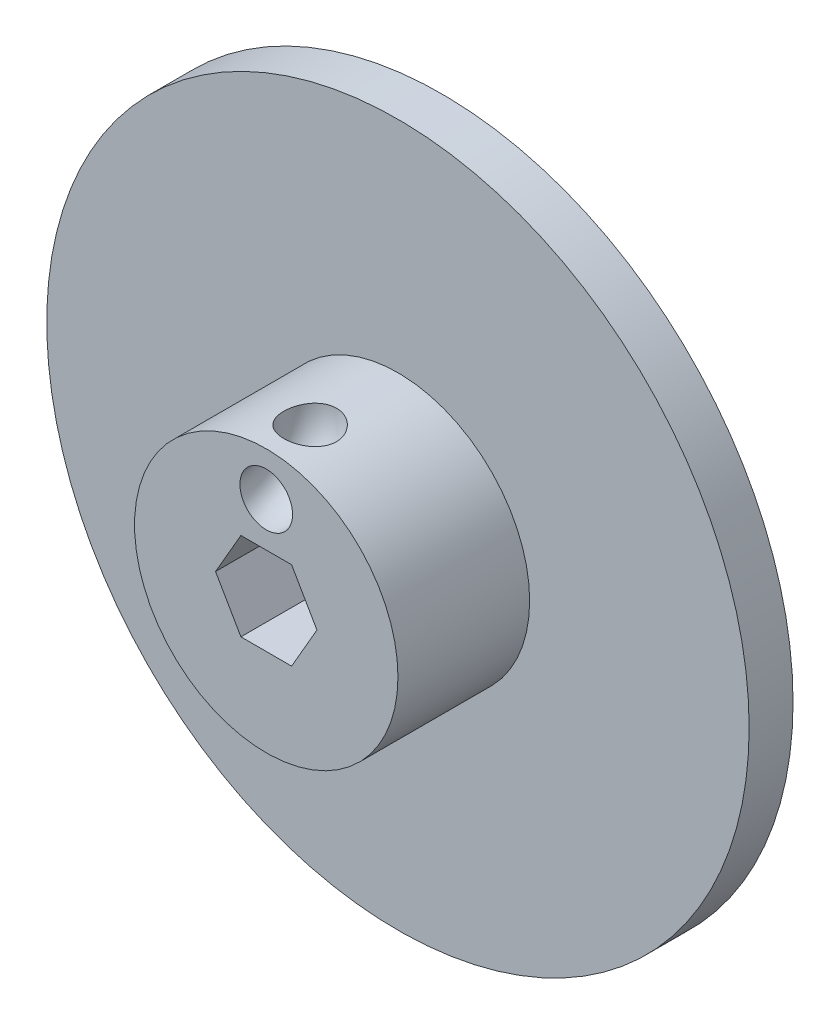
ISO-10303-21;
HEADER;
FILE_DESCRIPTION(('STEP AP214'),'2;1');
FILE_NAME('part.step','',(''),(''),'','','');
FILE_SCHEMA(('AUTOMOTIVE_DESIGN { 1 0 10303 214 1 1 1 1 }'));
ENDSEC;
DATA;
#1=APPLICATION_CONTEXT('core data for automotive mechanical design processes');
#2=APPLICATION_PROTOCOL_DEFINITION('international standard','automotive_design',2000,#1);
#3=PRODUCT_CONTEXT('',#1,'mechanical');
#4=PRODUCT('Part','Part','',(#3));
#5=PRODUCT_RELATED_PRODUCT_CATEGORY('part','',(#4));
#6=PRODUCT_DEFINITION_FORMATION('','',#4);
#7=PRODUCT_DEFINITION_CONTEXT('part definition',#1,'design');
#8=PRODUCT_DEFINITION('design','',#6,#7);
#9=PRODUCT_DEFINITION_SHAPE('','',#8);
#10=(LENGTH_UNIT() NAMED_UNIT(*) SI_UNIT(.MILLI.,.METRE.));
#11=(NAMED_UNIT(*) PLANE_ANGLE_UNIT() SI_UNIT($,.RADIAN.));
#12=(NAMED_UNIT(*) SI_UNIT($,.STERADIAN.) SOLID_ANGLE_UNIT());
#13=UNCERTAINTY_MEASURE_WITH_UNIT(LENGTH_MEASURE(1.E-05),#10,'distance_accuracy_value','');
#14=(GEOMETRIC_REPRESENTATION_CONTEXT(3) GLOBAL_UNCERTAINTY_ASSIGNED_CONTEXT((#13)) GLOBAL_UNIT_ASSIGNED_CONTEXT((#10,
#11,#12)) REPRESENTATION_CONTEXT('',''));
#15=CARTESIAN_POINT('',(0.,0.,0.));
#16=DIRECTION('',(0.,0.,1.));
#17=DIRECTION('',(1.,0.,0.));
#18=AXIS2_PLACEMENT_3D('',#15,#16,#17);
#19=CARTESIAN_POINT('',(0.,0.,6.35));
#20=DIRECTION('',(0.,0.,-1.));
#21=DIRECTION('',(-1.,0.,0.));
#22=AXIS2_PLACEMENT_3D('',#19,#20,#21);
#23=CYLINDRICAL_SURFACE('',#22,50.8);
#24=CARTESIAN_POINT('',(0.,0.,6.35));
#25=DIRECTION('',(0.,0.,1.));
#26=DIRECTION('',(1.,0.,0.));
#27=AXIS2_PLACEMENT_3D('',#24,#25,#26);
#28=CIRCLE('',#27,50.8);
#29=CARTESIAN_POINT('',(50.8,0.,6.35));
#30=VERTEX_POINT('',#29);
#31=EDGE_CURVE('E48',#30,#30,#28,.T.);
#32=ORIENTED_EDGE('',*,*,#31,.F.);
#33=EDGE_LOOP('',(#32));
#34=FACE_BOUND('',#33,.T.);
#35=CARTESIAN_POINT('',(0.,0.,0.));
#36=DIRECTION('',(0.,0.,1.));
#37=DIRECTION('',(1.,0.,0.));
#38=AXIS2_PLACEMENT_3D('',#35,#36,#37);
#39=CIRCLE('',#38,50.8);
#40=CARTESIAN_POINT('',(50.8,0.,0.));
#41=VERTEX_POINT('',#40);
#42=EDGE_CURVE('E42',#41,#41,#39,.T.);
#43=ORIENTED_EDGE('',*,*,#42,.T.);
#44=EDGE_LOOP('',(#43));
#45=FACE_BOUND('',#44,.T.);
#46=ADVANCED_FACE('F39',(#34,#45),#23,.T.);
#47=CARTESIAN_POINT('',(0.,0.,6.35));
#48=DIRECTION('',(0.,0.,1.));
#49=DIRECTION('',(1.,0.,0.));
#50=AXIS2_PLACEMENT_3D('',#47,#48,#49);
#51=PLANE('',#50);
#52=CARTESIAN_POINT('',(0.,0.,6.35));
#53=DIRECTION('',(0.,0.,1.));
#54=DIRECTION('',(1.,0.,0.));
#55=AXIS2_PLACEMENT_3D('',#52,#53,#54);
#56=CIRCLE('',#55,19.05);
#57=CARTESIAN_POINT('',(19.05,0.,6.35));
#58=VERTEX_POINT('',#57);
#59=EDGE_CURVE('E11',#58,#58,#56,.T.);
#60=ORIENTED_EDGE('',*,*,#59,.F.);
#61=EDGE_LOOP('',(#60));
#62=FACE_BOUND('',#61,.T.);
#63=ORIENTED_EDGE('',*,*,#31,.T.);
#64=EDGE_LOOP('',(#63));
#65=FACE_BOUND('',#64,.T.);
#66=ADVANCED_FACE('F163',(#62,#65),#51,.T.);
#67=CARTESIAN_POINT('',(0.,0.,0.));
#68=DIRECTION('',(0.,0.,1.));
#69=DIRECTION('',(1.,0.,0.));
#70=AXIS2_PLACEMENT_3D('',#67,#68,#69);
#71=PLANE('',#70);
#72=DIRECTION('',(0.5,-0.866025403784439,0.));
#73=VECTOR('',#72,1.);
#74=CARTESIAN_POINT('',(5.49926131403118,3.175,0.));
#75=LINE('',#74,#73);
#76=CARTESIAN_POINT('',(3.66617420935412,6.35,0.));
#77=VERTEX_POINT('',#76);
#78=CARTESIAN_POINT('',(7.33234841870825,0.,0.));
#79=VERTEX_POINT('',#78);
#80=EDGE_CURVE('E292',#77,#79,#75,.T.);
#81=ORIENTED_EDGE('',*,*,#80,.F.);
#82=DIRECTION('',(1.,0.,0.));
#83=VECTOR('',#82,1.);
#84=CARTESIAN_POINT('',(0.,6.35,0.));
#85=LINE('',#84,#83);
#86=CARTESIAN_POINT('',(-3.66617420935412,6.35,0.));
#87=VERTEX_POINT('',#86);
#88=EDGE_CURVE('E148',#87,#77,#85,.T.);
#89=ORIENTED_EDGE('',*,*,#88,.F.);
#90=DIRECTION('',(0.5,0.866025403784439,0.));
#91=VECTOR('',#90,1.);
#92=CARTESIAN_POINT('',(-5.49926131403118,3.175,0.));
#93=LINE('',#92,#91);
#94=CARTESIAN_POINT('',(-7.33234841870825,0.,0.));
#95=VERTEX_POINT('',#94);
#96=EDGE_CURVE('E144',#95,#87,#93,.T.);
#97=ORIENTED_EDGE('',*,*,#96,.F.);
#98=DIRECTION('',(-0.5,0.866025403784439,0.));
#99=VECTOR('',#98,1.);
#100=CARTESIAN_POINT('',(-5.49926131403118,-3.175,0.));
#101=LINE('',#100,#99);
#102=CARTESIAN_POINT('',(-3.66617420935412,-6.35,0.));
#103=VERTEX_POINT('',#102);
#104=EDGE_CURVE('E100',#103,#95,#101,.T.);
#105=ORIENTED_EDGE('',*,*,#104,.F.);
#106=DIRECTION('',(-1.,0.,0.));
#107=VECTOR('',#106,1.);
#108=CARTESIAN_POINT('',(0.,-6.35,0.));
#109=LINE('',#108,#107);
#110=CARTESIAN_POINT('',(3.66617420935412,-6.35,0.));
#111=VERTEX_POINT('',#110);
#112=EDGE_CURVE('E286',#111,#103,#109,.T.);
#113=ORIENTED_EDGE('',*,*,#112,.F.);
#114=DIRECTION('',(-0.5,-0.866025403784439,0.));
#115=VECTOR('',#114,1.);
#116=CARTESIAN_POINT('',(5.49926131403119,-3.175,0.));
#117=LINE('',#116,#115);
#118=EDGE_CURVE('E289',#79,#111,#117,.T.);
#119=ORIENTED_EDGE('',*,*,#118,.F.);
#120=EDGE_LOOP('',(#81,#89,#97,#105,#113,#119));
#121=FACE_BOUND('',#120,.T.);
#122=ORIENTED_EDGE('',*,*,#42,.F.);
#123=EDGE_LOOP('',(#122));
#124=FACE_BOUND('',#123,.T.);
#125=ADVANCED_FACE('F160',(#121,#124),#71,.F.);
#126=CARTESIAN_POINT('',(0.,0.,25.4));
#127=DIRECTION('',(0.,0.,-1.));
#128=DIRECTION('',(-1.,0.,0.));
#129=AXIS2_PLACEMENT_3D('',#126,#127,#128);
#130=CYLINDRICAL_SURFACE('',#129,19.05);
#131=CARTESIAN_POINT('',(-2.36133450839995,18.9030843869707,16.0611389284263));
#132=CARTESIAN_POINT('',(-2.19525586314394,18.923828220809,15.929645800081));
#133=CARTESIAN_POINT('',(-2.01802699297593,18.9437322055328,15.8119568698392));
#134=CARTESIAN_POINT('',(-1.64603116612238,18.9796732037944,15.6075994522687));
#135=CARTESIAN_POINT('',(-1.45125332077044,18.9957077934662,15.5209503925557));
#136=CARTESIAN_POINT('',(-1.04952373230109,19.0221316257196,15.3812671540948));
#137=CARTESIAN_POINT('',(-0.842567455102802,19.0325187508004,15.3282455826394));
#138=CARTESIAN_POINT('',(-0.422513539932707,19.0464724397128,15.2575142013166));
#139=CARTESIAN_POINT('',(-0.209417089514965,19.0500403135679,15.2397976091005));
#140=CARTESIAN_POINT('',(0.214437118335055,19.0499594222012,15.2402037031939));
#141=CARTESIAN_POINT('',(0.425195355168822,19.0463879366609,15.2579426028371));
#142=CARTESIAN_POINT('',(0.840667078442666,19.0325772843426,15.3279488112711));
#143=CARTESIAN_POINT('',(1.04538048300476,19.0223380272923,15.3802165875357));
#144=CARTESIAN_POINT('',(1.44289792228653,18.9963214775792,15.5176673139248));
#145=CARTESIAN_POINT('',(1.63570974367154,18.9805478519471,15.6028284729025));
#146=CARTESIAN_POINT('',(2.00437110747481,18.9451665304545,15.8036128991351));
#147=CARTESIAN_POINT('',(2.18021928868547,18.9255585272948,15.9192386081733));
#148=CARTESIAN_POINT('',(2.51276227122529,18.8843070011458,16.1796516917446));
#149=CARTESIAN_POINT('',(2.66913903429093,18.8626378841306,16.3248411509205));
#150=CARTESIAN_POINT('',(2.95555421766357,18.8198889134928,16.6393021945186));
#151=CARTESIAN_POINT('',(3.08559039691075,18.7988091101406,16.8085758259408));
#152=CARTESIAN_POINT('',(3.31720050918375,18.7593360997349,17.1687231562689));
#153=CARTESIAN_POINT('',(3.41842442721551,18.7409771313439,17.3598259594327));
#154=CARTESIAN_POINT('',(3.58747893055218,18.7093542181964,17.7566726373066));
#155=CARTESIAN_POINT('',(3.65531060111586,18.6960901078585,17.9624160359439));
#156=CARTESIAN_POINT('',(3.75518132783401,18.6762875142141,18.3813386095091));
#157=CARTESIAN_POINT('',(3.78744743425661,18.6697063882947,18.5944615501686));
#158=CARTESIAN_POINT('',(3.81582672202588,18.6639275389834,19.0231953704714));
#159=CARTESIAN_POINT('',(3.81194405990768,18.6647289667148,19.238805961227));
#160=CARTESIAN_POINT('',(3.76832547765655,18.6735826524292,19.6626755808212));
#161=CARTESIAN_POINT('',(3.72917139504311,18.6815172374902,19.8709971200765));
#162=CARTESIAN_POINT('',(3.61685050137747,18.7035862452508,20.277902800408));
#163=CARTESIAN_POINT('',(3.54368508868154,18.7177204130567,20.4764873414442));
#164=CARTESIAN_POINT('',(3.36580534255427,18.7505187037414,20.8575671207976));
#165=CARTESIAN_POINT('',(3.26122038213005,18.7691641906976,21.0401244435863));
#166=CARTESIAN_POINT('',(3.02338625487891,18.8089374040074,21.3851958689435));
#167=CARTESIAN_POINT('',(2.89013427710228,18.8300653736892,21.5477080035168));
#168=CARTESIAN_POINT('',(2.59657945903196,18.8727989126584,21.850696290218));
#169=CARTESIAN_POINT('',(2.43591469889131,18.8944069781798,21.9908214043251));
#170=CARTESIAN_POINT('',(2.09334279909754,18.9354202288276,22.24255811561));
#171=CARTESIAN_POINT('',(1.91143299493801,18.9548251370358,22.3541661306286));
#172=CARTESIAN_POINT('',(1.52897088545822,18.9895239205547,22.5470066953374));
#173=CARTESIAN_POINT('',(1.32821848371764,19.0047648390714,22.6278526737605));
#174=CARTESIAN_POINT('',(0.915646845834151,19.0291025477661,22.7546844671033));
#175=CARTESIAN_POINT('',(0.703829668054454,19.0382004763607,22.8006767412916));
#176=CARTESIAN_POINT('',(0.278156932831729,19.0491427081411,22.8558003696215));
#177=CARTESIAN_POINT('',(0.0643669489731138,19.0510827809106,22.8654184417665));
#178=CARTESIAN_POINT('',(-0.361747069174843,19.0477566379511,22.8487766621618));
#179=CARTESIAN_POINT('',(-0.574071159263908,19.0424906980583,22.8225181837171));
#180=CARTESIAN_POINT('',(-0.988316850924207,19.0254610506686,22.7356861914135));
#181=CARTESIAN_POINT('',(-1.1903393814927,19.013784882158,22.6755746997565));
#182=CARTESIAN_POINT('',(-1.58153721954854,18.9852506334993,22.5232997099407));
#183=CARTESIAN_POINT('',(-1.77071070548334,18.9683918204948,22.4311316785563));
#184=CARTESIAN_POINT('',(-2.13429958022966,18.9309604869884,22.2154794622191));
#185=CARTESIAN_POINT('',(-2.30840781630233,18.910329469675,22.0914874212244));
#186=CARTESIAN_POINT('',(-2.6334068520676,18.8678185500035,21.8162705802422));
#187=CARTESIAN_POINT('',(-2.78429722145633,18.8459386245092,21.665045275645));
#188=CARTESIAN_POINT('',(-3.05992565327376,18.8031657705013,21.337711296829));
#189=CARTESIAN_POINT('',(-3.18439890528727,18.7822843259702,21.161377798582));
#190=CARTESIAN_POINT('',(-3.4016172560729,18.7441648959125,20.7897863753964));
#191=CARTESIAN_POINT('',(-3.4943651942277,18.7269265843821,20.5945301460309));
#192=CARTESIAN_POINT('',(-3.64425676141306,18.6983332903439,20.1936050134529));
#193=CARTESIAN_POINT('',(-3.70189245809832,18.6868973917929,19.9881258587498));
#194=CARTESIAN_POINT('',(-3.78199327350098,18.670852197168,19.5701766859341));
#195=CARTESIAN_POINT('',(-3.80446160664773,18.666242277176,19.357707308567));
#196=CARTESIAN_POINT('',(-3.8136722113199,18.6643622892394,18.9345869322521));
#197=CARTESIAN_POINT('',(-3.80084847252086,18.6670030580109,18.7239455146251));
#198=CARTESIAN_POINT('',(-3.74094614219123,18.6790989341833,18.3077651644254));
#199=CARTESIAN_POINT('',(-3.69386135564,18.6885552739605,18.1022271615945));
#200=CARTESIAN_POINT('',(-3.56642217064929,18.7132933826247,17.7004268825133));
#201=CARTESIAN_POINT('',(-3.48582075767083,18.7286183349157,17.5042457892313));
#202=CARTESIAN_POINT('',(-3.2936425252753,18.7633658438374,17.1282065285355));
#203=CARTESIAN_POINT('',(-3.18208455738585,18.7827859049585,16.9483385151609));
#204=CARTESIAN_POINT('',(-2.95706827318457,18.8193618121488,16.6447636214539));
#205=CARTESIAN_POINT('',(-2.84878465825547,18.8361540785701,16.5171390010707));
#206=CARTESIAN_POINT('',(-2.61642531933562,18.8698332432879,16.2771922389202));
#207=CARTESIAN_POINT('',(-2.49234941866549,18.8867201426411,16.1648702683835));
#208=CARTESIAN_POINT('',(-2.36133450839995,18.9030843869707,16.0611389284263));
#209=B_SPLINE_CURVE_WITH_KNOTS('',3,(#131,#132,#133,#134,#135,#136,#137,#138,#139,#140,#141,
#142,#143,#144,#145,#146,#147,#148,#149,#150,#151,#152,#153,#154,#155,#156,#157,#158,#159,#160,
#161,#162,#163,#164,#165,#166,#167,#168,#169,#170,#171,#172,#173,#174,#175,#176,#177,#178,#179,
#180,#181,#182,#183,#184,#185,#186,#187,#188,#189,#190,#191,#192,#193,#194,#195,#196,#197,#198,
#199,#200,#201,#202,#203,#204,#205,#206,#207,#208),.UNSPECIFIED.,.T.,.F.,(4,2,2,2,2,2,2,2,2,2,2,
2,2,2,2,2,2,2,2,2,2,2,2,2,2,2,2,2,2,2,2,2,2,2,2,2,2,2,4),(0.,0.637942131062747,1.27628285042006,
1.91486274905096,2.55331995990799,3.18490364007232,3.81649587119335,4.44767040194456,
5.0788955377628,5.71936033712411,6.35987960443607,7.00787680418773,7.65585294243174,
8.29966800767003,8.9434090452998,9.57672155373532,10.210008026194,10.8407218117323,
11.4714974702393,12.1113568024783,12.7512964708127,13.3990313929085,14.0466462440416,
14.6855641505475,15.3244576008396,15.954835752055,16.5853030834866,17.2265357526563,
17.8677803045574,18.5151773210011,19.1625163809139,19.8005613165933,20.4385479291585,
21.0687243371614,21.6990147208466,22.3340350109994,22.9686694400496,23.4719189444508,
23.9751740795523),.UNSPECIFIED.);
#210=CARTESIAN_POINT('',(-2.36133450839995,18.9030843869707,16.0611389284263));
#211=VERTEX_POINT('',#210);
#212=EDGE_CURVE('E274',#211,#211,#209,.T.);
#213=ORIENTED_EDGE('',*,*,#212,.T.);
#214=EDGE_LOOP('',(#213));
#215=FACE_BOUND('',#214,.T.);
#216=CARTESIAN_POINT('',(0.,0.,25.4));
#217=DIRECTION('',(0.,0.,1.));
#218=DIRECTION('',(1.,0.,0.));
#219=AXIS2_PLACEMENT_3D('',#216,#217,#218);
#220=CIRCLE('',#219,19.05);
#221=CARTESIAN_POINT('',(19.05,0.,25.4));
#222=VERTEX_POINT('',#221);
#223=EDGE_CURVE('E147',#222,#222,#220,.T.);
#224=ORIENTED_EDGE('',*,*,#223,.F.);
#225=EDGE_LOOP('',(#224));
#226=FACE_BOUND('',#225,.T.);
#227=ORIENTED_EDGE('',*,*,#59,.T.);
#228=EDGE_LOOP('',(#227));
#229=FACE_BOUND('',#228,.T.);
#230=ADVANCED_FACE('F162',(#215,#226,#229),#130,.T.);
#231=CARTESIAN_POINT('',(0.,0.,25.4));
#232=DIRECTION('',(0.,0.,1.));
#233=DIRECTION('',(1.,0.,0.));
#234=AXIS2_PLACEMENT_3D('',#231,#232,#233);
#235=PLANE('',#234);
#236=CARTESIAN_POINT('',(0.,12.7,25.4));
#237=DIRECTION('',(0.,0.,1.));
#238=DIRECTION('',(1.,0.,0.));
#239=AXIS2_PLACEMENT_3D('',#236,#237,#238);
#240=CIRCLE('',#239,3.81);
#241=CARTESIAN_POINT('',(3.81,12.7,25.4));
#242=VERTEX_POINT('',#241);
#243=EDGE_CURVE('E282',#242,#242,#240,.F.);
#244=ORIENTED_EDGE('',*,*,#243,.T.);
#245=EDGE_LOOP('',(#244));
#246=FACE_BOUND('',#245,.T.);
#247=DIRECTION('',(-1.,0.,0.));
#248=VECTOR('',#247,1.);
#249=CARTESIAN_POINT('',(0.,6.35,25.4));
#250=LINE('',#249,#248);
#251=CARTESIAN_POINT('',(3.66617420935412,6.35,25.4));
#252=VERTEX_POINT('',#251);
#253=CARTESIAN_POINT('',(-3.66617420935412,6.35,25.4));
#254=VERTEX_POINT('',#253);
#255=EDGE_CURVE('E64',#252,#254,#250,.T.);
#256=ORIENTED_EDGE('',*,*,#255,.F.);
#257=DIRECTION('',(-0.5,0.866025403784438,0.));
#258=VECTOR('',#257,1.);
#259=CARTESIAN_POINT('',(5.49926131403118,3.175,25.4));
#260=LINE('',#259,#258);
#261=CARTESIAN_POINT('',(7.33234841870825,0.,25.4));
#262=VERTEX_POINT('',#261);
#263=EDGE_CURVE('E127',#262,#252,#260,.T.);
#264=ORIENTED_EDGE('',*,*,#263,.F.);
#265=DIRECTION('',(0.5,0.866025403784439,0.));
#266=VECTOR('',#265,1.);
#267=CARTESIAN_POINT('',(5.49926131403119,-3.175,25.4));
#268=LINE('',#267,#266);
#269=CARTESIAN_POINT('',(3.66617420935412,-6.35,25.4));
#270=VERTEX_POINT('',#269);
#271=EDGE_CURVE('E120',#270,#262,#268,.T.);
#272=ORIENTED_EDGE('',*,*,#271,.F.);
#273=DIRECTION('',(1.,0.,0.));
#274=VECTOR('',#273,1.);
#275=CARTESIAN_POINT('',(0.,-6.35,25.4));
#276=LINE('',#275,#274);
#277=CARTESIAN_POINT('',(-3.66617420935412,-6.35,25.4));
#278=VERTEX_POINT('',#277);
#279=EDGE_CURVE('E116',#278,#270,#276,.T.);
#280=ORIENTED_EDGE('',*,*,#279,.F.);
#281=DIRECTION('',(0.5,-0.866025403784438,0.));
#282=VECTOR('',#281,1.);
#283=CARTESIAN_POINT('',(-5.49926131403118,-3.175,25.4));
#284=LINE('',#283,#282);
#285=CARTESIAN_POINT('',(-7.33234841870824,0.,25.4));
#286=VERTEX_POINT('',#285);
#287=EDGE_CURVE('E97',#286,#278,#284,.T.);
#288=ORIENTED_EDGE('',*,*,#287,.F.);
#289=DIRECTION('',(-0.5,-0.866025403784439,0.));
#290=VECTOR('',#289,1.);
#291=CARTESIAN_POINT('',(-5.49926131403118,3.175,25.4));
#292=LINE('',#291,#290);
#293=EDGE_CURVE('E107',#254,#286,#292,.T.);
#294=ORIENTED_EDGE('',*,*,#293,.F.);
#295=EDGE_LOOP('',(#256,#264,#272,#280,#288,#294));
#296=FACE_BOUND('',#295,.T.);
#297=ORIENTED_EDGE('',*,*,#223,.T.);
#298=EDGE_LOOP('',(#297));
#299=FACE_BOUND('',#298,.T.);
#300=ADVANCED_FACE('F112',(#246,#296,#299),#235,.T.);
#301=CARTESIAN_POINT('',(0.,6.35,-19.3995704419797));
#302=DIRECTION('',(0.,1.,0.));
#303=DIRECTION('',(-1.,0.,0.));
#304=AXIS2_PLACEMENT_3D('',#301,#302,#303);
#305=PLANE('',#304);
#306=ORIENTED_EDGE('',*,*,#88,.T.);
#307=DIRECTION('',(0.,0.,1.));
#308=VECTOR('',#307,1.);
#309=CARTESIAN_POINT('',(3.66617420935412,6.35,-19.3995704419797));
#310=LINE('',#309,#308);
#311=EDGE_CURVE('E131',#77,#252,#310,.T.);
#312=ORIENTED_EDGE('',*,*,#311,.T.);
#313=ORIENTED_EDGE('',*,*,#255,.T.);
#314=DIRECTION('',(0.,0.,1.));
#315=VECTOR('',#314,1.);
#316=CARTESIAN_POINT('',(-3.66617420935412,6.35,-19.3995704419797));
#317=LINE('',#316,#315);
#318=EDGE_CURVE('E104',#87,#254,#317,.T.);
#319=ORIENTED_EDGE('',*,*,#318,.F.);
#320=EDGE_LOOP('',(#306,#312,#313,#319));
#321=FACE_BOUND('',#320,.T.);
#322=ADVANCED_FACE('F192',(#321),#305,.F.);
#323=CARTESIAN_POINT('',(5.49926131403118,3.175,-19.3995704419797));
#324=DIRECTION('',(0.866025403784438,0.5,0.));
#325=DIRECTION('',(-0.5,0.866025403784439,0.));
#326=AXIS2_PLACEMENT_3D('',#323,#324,#325);
#327=PLANE('',#326);
#328=ORIENTED_EDGE('',*,*,#80,.T.);
#329=DIRECTION('',(0.,0.,1.));
#330=VECTOR('',#329,1.);
#331=CARTESIAN_POINT('',(7.33234841870825,0.,-19.3995704419797));
#332=LINE('',#331,#330);
#333=EDGE_CURVE('E134',#79,#262,#332,.T.);
#334=ORIENTED_EDGE('',*,*,#333,.T.);
#335=ORIENTED_EDGE('',*,*,#263,.T.);
#336=ORIENTED_EDGE('',*,*,#311,.F.);
#337=EDGE_LOOP('',(#328,#334,#335,#336));
#338=FACE_BOUND('',#337,.T.);
#339=ADVANCED_FACE('F197',(#338),#327,.F.);
#340=CARTESIAN_POINT('',(5.49926131403119,-3.175,-19.3995704419797));
#341=DIRECTION('',(0.866025403784439,-0.5,0.));
#342=DIRECTION('',(0.5,0.866025403784439,0.));
#343=AXIS2_PLACEMENT_3D('',#340,#341,#342);
#344=PLANE('',#343);
#345=ORIENTED_EDGE('',*,*,#118,.T.);
#346=DIRECTION('',(0.,0.,1.));
#347=VECTOR('',#346,1.);
#348=CARTESIAN_POINT('',(3.66617420935412,-6.35,-19.3995704419797));
#349=LINE('',#348,#347);
#350=EDGE_CURVE('E137',#111,#270,#349,.T.);
#351=ORIENTED_EDGE('',*,*,#350,.T.);
#352=ORIENTED_EDGE('',*,*,#271,.T.);
#353=ORIENTED_EDGE('',*,*,#333,.F.);
#354=EDGE_LOOP('',(#345,#351,#352,#353));
#355=FACE_BOUND('',#354,.T.);
#356=ADVANCED_FACE('F208',(#355),#344,.F.);
#357=CARTESIAN_POINT('',(0.,-6.35,-19.3995704419797));
#358=DIRECTION('',(0.,-1.,0.));
#359=DIRECTION('',(1.,0.,0.));
#360=AXIS2_PLACEMENT_3D('',#357,#358,#359);
#361=PLANE('',#360);
#362=ORIENTED_EDGE('',*,*,#112,.T.);
#363=DIRECTION('',(0.,0.,1.));
#364=VECTOR('',#363,1.);
#365=CARTESIAN_POINT('',(-3.66617420935412,-6.35,-19.3995704419797));
#366=LINE('',#365,#364);
#367=EDGE_CURVE('E103',#103,#278,#366,.T.);
#368=ORIENTED_EDGE('',*,*,#367,.T.);
#369=ORIENTED_EDGE('',*,*,#279,.T.);
#370=ORIENTED_EDGE('',*,*,#350,.F.);
#371=EDGE_LOOP('',(#362,#368,#369,#370));
#372=FACE_BOUND('',#371,.T.);
#373=ADVANCED_FACE('F218',(#372),#361,.F.);
#374=CARTESIAN_POINT('',(-5.49926131403118,-3.175,-19.3995704419797));
#375=DIRECTION('',(-0.866025403784438,-0.5,0.));
#376=DIRECTION('',(0.5,-0.866025403784439,0.));
#377=AXIS2_PLACEMENT_3D('',#374,#375,#376);
#378=PLANE('',#377);
#379=ORIENTED_EDGE('',*,*,#104,.T.);
#380=DIRECTION('',(0.,0.,1.));
#381=VECTOR('',#380,1.);
#382=CARTESIAN_POINT('',(-7.33234841870824,0.,-19.3995704419797));
#383=LINE('',#382,#381);
#384=EDGE_CURVE('E56',#95,#286,#383,.T.);
#385=ORIENTED_EDGE('',*,*,#384,.T.);
#386=ORIENTED_EDGE('',*,*,#287,.T.);
#387=ORIENTED_EDGE('',*,*,#367,.F.);
#388=EDGE_LOOP('',(#379,#385,#386,#387));
#389=FACE_BOUND('',#388,.T.);
#390=ADVANCED_FACE('F94',(#389),#378,.F.);
#391=CARTESIAN_POINT('',(-5.49926131403118,3.175,-19.3995704419797));
#392=DIRECTION('',(-0.866025403784439,0.5,0.));
#393=DIRECTION('',(-0.5,-0.866025403784439,0.));
#394=AXIS2_PLACEMENT_3D('',#391,#392,#393);
#395=PLANE('',#394);
#396=ORIENTED_EDGE('',*,*,#96,.T.);
#397=ORIENTED_EDGE('',*,*,#318,.T.);
#398=ORIENTED_EDGE('',*,*,#293,.T.);
#399=ORIENTED_EDGE('',*,*,#384,.F.);
#400=EDGE_LOOP('',(#396,#397,#398,#399));
#401=FACE_BOUND('',#400,.T.);
#402=ADVANCED_FACE('F108',(#401),#395,.F.);
#403=CARTESIAN_POINT('',(0.,19.05,25.4));
#404=DIRECTION('',(1.,0.,0.));
#405=DIRECTION('',(0.,1.,0.));
#406=AXIS2_PLACEMENT_3D('',#403,#404,#405);
#407=TOROIDAL_SURFACE('',#406,6.35,3.81);
#408=ORIENTED_EDGE('',*,*,#243,.F.);
#409=EDGE_LOOP('',(#408));
#410=FACE_BOUND('',#409,.T.);
#411=ORIENTED_EDGE('',*,*,#212,.F.);
#412=EDGE_LOOP('',(#411));
#413=FACE_BOUND('',#412,.T.);
#414=ADVANCED_FACE('F245',(#410,#413),#407,.F.);
#415=CLOSED_SHELL('',(#46,#66,#125,#230,#300,#322,#339,#356,#373,#390,#402,#414));
#416=MANIFOLD_SOLID_BREP('B2',#415);
#417=ADVANCED_BREP_SHAPE_REPRESENTATION('',(#18,#416),#14);
#418=SHAPE_DEFINITION_REPRESENTATION(#9,#417);
ENDSEC;
END-ISO-10303-21;
